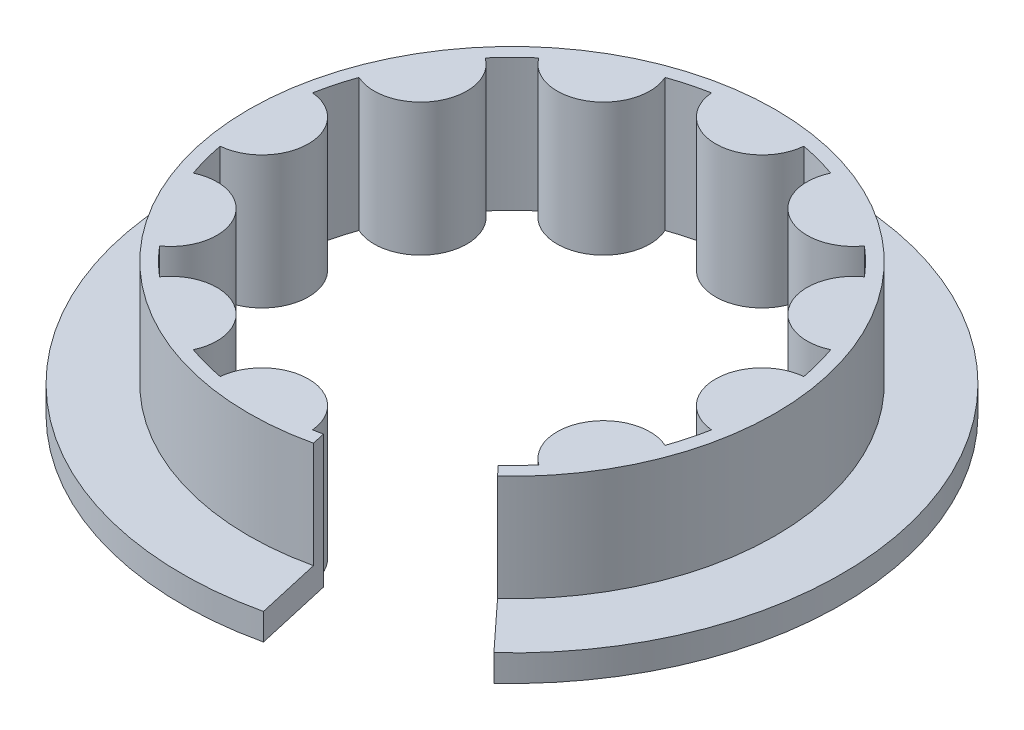
ISO-10303-21;
HEADER;
FILE_DESCRIPTION(('STEP AP214'),'2;1');
FILE_NAME('part.step','',(''),(''),'','','');
FILE_SCHEMA(('AUTOMOTIVE_DESIGN { 1 0 10303 214 1 1 1 1 }'));
ENDSEC;
DATA;
#1=APPLICATION_CONTEXT('core data for automotive mechanical design processes');
#2=APPLICATION_PROTOCOL_DEFINITION('international standard','automotive_design',2000,#1);
#3=PRODUCT_CONTEXT('',#1,'mechanical');
#4=PRODUCT('Part','Part','',(#3));
#5=PRODUCT_RELATED_PRODUCT_CATEGORY('part','',(#4));
#6=PRODUCT_DEFINITION_FORMATION('','',#4);
#7=PRODUCT_DEFINITION_CONTEXT('part definition',#1,'design');
#8=PRODUCT_DEFINITION('design','',#6,#7);
#9=PRODUCT_DEFINITION_SHAPE('','',#8);
#10=(LENGTH_UNIT() NAMED_UNIT(*) SI_UNIT(.MILLI.,.METRE.));
#11=(NAMED_UNIT(*) PLANE_ANGLE_UNIT() SI_UNIT($,.RADIAN.));
#12=(NAMED_UNIT(*) SI_UNIT($,.STERADIAN.) SOLID_ANGLE_UNIT());
#13=UNCERTAINTY_MEASURE_WITH_UNIT(LENGTH_MEASURE(1.E-05),#10,'distance_accuracy_value','');
#14=(GEOMETRIC_REPRESENTATION_CONTEXT(3) GLOBAL_UNCERTAINTY_ASSIGNED_CONTEXT((#13)) GLOBAL_UNIT_ASSIGNED_CONTEXT((#10,
#11,#12)) REPRESENTATION_CONTEXT('',''));
#15=CARTESIAN_POINT('',(0.,0.,0.));
#16=DIRECTION('',(0.,0.,1.));
#17=DIRECTION('',(1.,0.,0.));
#18=AXIS2_PLACEMENT_3D('',#15,#16,#17);
#19=CARTESIAN_POINT('',(-0.572563935418701,5.,1.24466409401336E-13));
#20=DIRECTION('',(0.,-1.,0.));
#21=DIRECTION('',(0.,0.,-1.));
#22=AXIS2_PLACEMENT_3D('',#19,#20,#21);
#23=CYLINDRICAL_SURFACE('',#22,12.4274360645813);
#24=DIRECTION('',(0.,1.,0.));
#25=VECTOR('',#24,1.);
#26=CARTESIAN_POINT('',(7.86676479083981,0.,9.12243924558592));
#27=LINE('',#26,#25);
#28=CARTESIAN_POINT('',(7.86676479083981,0.,9.12243924558592));
#29=VERTEX_POINT('',#28);
#30=CARTESIAN_POINT('',(7.86676479083981,1.,9.12243924558592));
#31=VERTEX_POINT('',#30);
#32=EDGE_CURVE('E67',#29,#31,#27,.T.);
#33=ORIENTED_EDGE('',*,*,#32,.F.);
#34=CARTESIAN_POINT('',(-0.572563935418701,0.,1.24466409401336E-13));
#35=DIRECTION('',(0.,1.,0.));
#36=DIRECTION('',(0.,0.,1.));
#37=AXIS2_PLACEMENT_3D('',#34,#35,#36);
#38=CIRCLE('',#37,12.4274360645813);
#39=CARTESIAN_POINT('',(2.17488950961602,0.,12.1199284942868));
#40=VERTEX_POINT('',#39);
#41=EDGE_CURVE('E247',#29,#40,#38,.T.);
#42=ORIENTED_EDGE('',*,*,#41,.T.);
#43=DIRECTION('',(0.,1.,0.));
#44=VECTOR('',#43,1.);
#45=CARTESIAN_POINT('',(2.17488950961602,0.,12.1199284942868));
#46=LINE('',#45,#44);
#47=CARTESIAN_POINT('',(2.17488950961602,1.,12.1199284942868));
#48=VERTEX_POINT('',#47);
#49=EDGE_CURVE('E433',#40,#48,#46,.T.);
#50=ORIENTED_EDGE('',*,*,#49,.T.);
#51=CARTESIAN_POINT('',(-0.572563935418701,1.,1.24466409401336E-13));
#52=DIRECTION('',(0.,1.,0.));
#53=DIRECTION('',(0.,0.,1.));
#54=AXIS2_PLACEMENT_3D('',#51,#52,#53);
#55=CIRCLE('',#54,12.4274360645813);
#56=EDGE_CURVE('E282',#48,#31,#55,.F.);
#57=ORIENTED_EDGE('',*,*,#56,.T.);
#58=EDGE_LOOP('',(#33,#42,#50,#57));
#59=FACE_BOUND('',#58,.T.);
#60=ADVANCED_FACE('F43',(#59),#23,.T.);
#61=CARTESIAN_POINT('',(-0.572563935418701,5.,1.24466409401336E-13));
#62=DIRECTION('',(0.,-1.,0.));
#63=DIRECTION('',(0.,0.,-1.));
#64=AXIS2_PLACEMENT_3D('',#61,#62,#63);
#65=CYLINDRICAL_SURFACE('',#64,9.4274360645813);
#66=CARTESIAN_POINT('',(-0.572563935418701,0.,1.24466409401336E-13));
#67=DIRECTION('',(0.,1.,0.));
#68=DIRECTION('',(0.,0.,1.));
#69=AXIS2_PLACEMENT_3D('',#66,#67,#68);
#70=CIRCLE('',#69,9.4274360645813);
#71=CARTESIAN_POINT('',(5.82949933662976,0.,6.92026998118267));
#72=VERTEX_POINT('',#71);
#73=CARTESIAN_POINT('',(6.5799481179883,0.,6.14150812729554));
#74=VERTEX_POINT('',#73);
#75=EDGE_CURVE('E243',#72,#74,#70,.T.);
#76=ORIENTED_EDGE('',*,*,#75,.F.);
#77=DIRECTION('',(0.,1.,0.));
#78=VECTOR('',#77,1.);
#79=CARTESIAN_POINT('',(5.82949933662976,0.,6.92026998118267));
#80=LINE('',#79,#78);
#81=CARTESIAN_POINT('',(5.82949933662976,5.,6.92026998118267));
#82=VERTEX_POINT('',#81);
#83=EDGE_CURVE('E226',#72,#82,#80,.T.);
#84=ORIENTED_EDGE('',*,*,#83,.T.);
#85=CARTESIAN_POINT('',(-0.572563935418701,5.,1.24466409401336E-13));
#86=DIRECTION('',(0.,1.,0.));
#87=DIRECTION('',(0.,0.,1.));
#88=AXIS2_PLACEMENT_3D('',#85,#86,#87);
#89=CIRCLE('',#88,9.4274360645813);
#90=CARTESIAN_POINT('',(6.5799481179883,5.,6.14150812729554));
#91=VERTEX_POINT('',#90);
#92=EDGE_CURVE('E368',#82,#91,#89,.T.);
#93=ORIENTED_EDGE('',*,*,#92,.T.);
#94=DIRECTION('',(0.,-1.,0.));
#95=VECTOR('',#94,1.);
#96=CARTESIAN_POINT('',(6.5799481179883,5.,6.14150812729554));
#97=LINE('',#96,#95);
#98=EDGE_CURVE('E253',#91,#74,#97,.T.);
#99=ORIENTED_EDGE('',*,*,#98,.T.);
#100=EDGE_LOOP('',(#76,#84,#93,#99));
#101=FACE_BOUND('',#100,.T.);
#102=ADVANCED_FACE('F251',(#101),#65,.F.);
#103=CARTESIAN_POINT('',(-0.572563935418701,-35.1500972561108,1.24466409401336E-13));
#104=DIRECTION('',(0.,1.,0.));
#105=DIRECTION('',(0.,0.,1.));
#106=AXIS2_PLACEMENT_3D('',#103,#104,#105);
#107=CYLINDRICAL_SURFACE('',#106,9.9274360645813);
#108=CARTESIAN_POINT('',(-0.572563935418701,5.,1.24466409401336E-13));
#109=DIRECTION('',(0.,1.,0.));
#110=DIRECTION('',(0.,0.,1.));
#111=AXIS2_PLACEMENT_3D('',#108,#109,#110);
#112=CIRCLE('',#111,9.9274360645813);
#113=CARTESIAN_POINT('',(6.1690435789981,5.,7.28729819191654));
#114=VERTEX_POINT('',#113);
#115=CARTESIAN_POINT('',(1.62219033845209,5.,9.68178911636056));
#116=VERTEX_POINT('',#115);
#117=EDGE_CURVE('E443',#114,#116,#112,.T.);
#118=ORIENTED_EDGE('',*,*,#117,.F.);
#119=DIRECTION('',(0.,1.,0.));
#120=VECTOR('',#119,1.);
#121=CARTESIAN_POINT('',(6.1690435789981,-35.1500972561108,7.28729819191654));
#122=LINE('',#121,#120);
#123=CARTESIAN_POINT('',(6.1690435789981,1.,7.28729819191654));
#124=VERTEX_POINT('',#123);
#125=EDGE_CURVE('E447',#114,#124,#122,.F.);
#126=ORIENTED_EDGE('',*,*,#125,.T.);
#127=CARTESIAN_POINT('',(-0.572563935418701,1.,1.24466409401336E-13));
#128=DIRECTION('',(0.,1.,0.));
#129=DIRECTION('',(0.,0.,1.));
#130=AXIS2_PLACEMENT_3D('',#127,#128,#129);
#131=CIRCLE('',#130,9.9274360645813);
#132=CARTESIAN_POINT('',(1.62219033845209,1.,9.68178911636056));
#133=VERTEX_POINT('',#132);
#134=EDGE_CURVE('E274',#133,#124,#131,.F.);
#135=ORIENTED_EDGE('',*,*,#134,.F.);
#136=DIRECTION('',(0.,1.,0.));
#137=VECTOR('',#136,1.);
#138=CARTESIAN_POINT('',(1.62219033845209,-35.1500972561108,9.68178911636056));
#139=LINE('',#138,#137);
#140=EDGE_CURVE('E59',#116,#133,#139,.F.);
#141=ORIENTED_EDGE('',*,*,#140,.F.);
#142=EDGE_LOOP('',(#118,#126,#135,#141));
#143=FACE_BOUND('',#142,.T.);
#144=ADVANCED_FACE('F567',(#143),#107,.T.);
#145=CARTESIAN_POINT('',(0.,1.,0.));
#146=DIRECTION('',(0.,1.,0.));
#147=DIRECTION('',(0.,0.,1.));
#148=AXIS2_PLACEMENT_3D('',#145,#146,#147);
#149=PLANE('',#148);
#150=ORIENTED_EDGE('',*,*,#134,.T.);
#151=DIRECTION('',(0.679088484736682,0.,0.734056421467749));
#152=VECTOR('',#151,1.);
#153=CARTESIAN_POINT('',(-0.30851968100289,1.,0.285416974167703));
#154=LINE('',#153,#152);
#155=EDGE_CURVE('E12',#124,#31,#154,.T.);
#156=ORIENTED_EDGE('',*,*,#155,.T.);
#157=ORIENTED_EDGE('',*,*,#56,.F.);
#158=DIRECTION('',(0.221079668465572,0.,0.975255751170509));
#159=VECTOR('',#158,1.);
#160=CARTESIAN_POINT('',(-0.544579174656585,1.,0.123450062449602));
#161=LINE('',#160,#159);
#162=EDGE_CURVE('E52',#133,#48,#161,.T.);
#163=ORIENTED_EDGE('',*,*,#162,.F.);
#164=EDGE_LOOP('',(#150,#156,#157,#163));
#165=FACE_BOUND('',#164,.T.);
#166=ADVANCED_FACE('F441',(#165),#149,.T.);
#167=CARTESIAN_POINT('',(0.,5.,0.));
#168=DIRECTION('',(0.,1.,0.));
#169=DIRECTION('',(0.,0.,1.));
#170=AXIS2_PLACEMENT_3D('',#167,#168,#169);
#171=PLANE('',#170);
#172=ORIENTED_EDGE('',*,*,#92,.F.);
#173=DIRECTION('',(0.679088484736682,0.,0.734056421467749));
#174=VECTOR('',#173,1.);
#175=CARTESIAN_POINT('',(-0.30851968100289,5.,0.285416974167703));
#176=LINE('',#175,#174);
#177=EDGE_CURVE('E231',#82,#114,#176,.T.);
#178=ORIENTED_EDGE('',*,*,#177,.T.);
#179=ORIENTED_EDGE('',*,*,#117,.T.);
#180=DIRECTION('',(0.221079668465572,0.,0.975255751170509));
#181=VECTOR('',#180,1.);
#182=CARTESIAN_POINT('',(-0.544579174656585,5.,0.123450062449602));
#183=LINE('',#182,#181);
#184=CARTESIAN_POINT('',(1.51165050421931,5.,9.1941612407753));
#185=VERTEX_POINT('',#184);
#186=EDGE_CURVE('E249',#185,#116,#183,.T.);
#187=ORIENTED_EDGE('',*,*,#186,.F.);
#188=CARTESIAN_POINT('',(1.16988209366398,5.,9.26501120277275));
#189=VERTEX_POINT('',#188);
#190=EDGE_CURVE('E262',#189,#185,#89,.T.);
#191=ORIENTED_EDGE('',*,*,#190,.F.);
#192=CARTESIAN_POINT('',(-0.572563935418825,5.,9.42743606458142));
#193=DIRECTION('',(0.,1.,0.));
#194=DIRECTION('',(0.,0.,1.));
#195=AXIS2_PLACEMENT_3D('',#192,#193,#194);
#196=CIRCLE('',#195,1.75);
#197=CARTESIAN_POINT('',(-2.31500996450162,5.,9.2650112027727));
#198=VERTEX_POINT('',#197);
#199=EDGE_CURVE('E455',#189,#198,#196,.T.);
#200=ORIENTED_EDGE('',*,*,#199,.T.);
#201=CARTESIAN_POINT('',(-3.69606701089609,5.,8.89495808248997));
#202=VERTEX_POINT('',#201);
#203=EDGE_CURVE('E456',#202,#198,#89,.T.);
#204=ORIENTED_EDGE('',*,*,#203,.F.);
#205=CARTESIAN_POINT('',(-5.28628196770945,5.,8.16439912448106));
#206=DIRECTION('',(0.,1.,0.));
#207=DIRECTION('',(0.,0.,1.));
#208=AXIS2_PLACEMENT_3D('',#205,#206,#207);
#209=CIRCLE('',#208,1.75);
#210=CARTESIAN_POINT('',(-6.71407206271411,5.,7.15251205340713));
#211=VERTEX_POINT('',#210);
#212=EDGE_CURVE('E459',#202,#211,#209,.T.);
#213=ORIENTED_EDGE('',*,*,#212,.T.);
#214=CARTESIAN_POINT('',(-7.72507598882586,5.,6.14150812729536));
#215=VERTEX_POINT('',#214);
#216=EDGE_CURVE('E462',#215,#211,#89,.T.);
#217=ORIENTED_EDGE('',*,*,#216,.F.);
#218=CARTESIAN_POINT('',(-8.73696305989976,5.,4.71371803229067));
#219=DIRECTION('',(0.,1.,0.));
#220=DIRECTION('',(0.,0.,1.));
#221=AXIS2_PLACEMENT_3D('',#218,#219,#220);
#222=CIRCLE('',#221,1.75);
#223=CARTESIAN_POINT('',(-9.46752201790862,5.,3.12350307547728));
#224=VERTEX_POINT('',#223);
#225=EDGE_CURVE('E463',#215,#224,#222,.T.);
#226=ORIENTED_EDGE('',*,*,#225,.T.);
#227=CARTESIAN_POINT('',(-9.83757513819132,5.,1.7424460290828));
#228=VERTEX_POINT('',#227);
#229=EDGE_CURVE('E466',#228,#224,#89,.T.);
#230=ORIENTED_EDGE('',*,*,#229,.F.);
#231=CARTESIAN_POINT('',(-10.,5.,0.));
#232=DIRECTION('',(0.,1.,0.));
#233=DIRECTION('',(0.,0.,1.));
#234=AXIS2_PLACEMENT_3D('',#231,#232,#233);
#235=CIRCLE('',#234,1.75);
#236=CARTESIAN_POINT('',(-9.83757513819127,5.,-1.7424460290828));
#237=VERTEX_POINT('',#236);
#238=EDGE_CURVE('E467',#228,#237,#235,.T.);
#239=ORIENTED_EDGE('',*,*,#238,.T.);
#240=CARTESIAN_POINT('',(-9.46752201790854,5.,-3.12350307547727));
#241=VERTEX_POINT('',#240);
#242=EDGE_CURVE('E470',#241,#237,#89,.T.);
#243=ORIENTED_EDGE('',*,*,#242,.F.);
#244=CARTESIAN_POINT('',(-8.73696305989963,5.,-4.71371803229064));
#245=DIRECTION('',(0.,1.,0.));
#246=DIRECTION('',(0.,0.,1.));
#247=AXIS2_PLACEMENT_3D('',#244,#245,#246);
#248=CIRCLE('',#247,1.75);
#249=CARTESIAN_POINT('',(-7.7250759888257,5.,-6.1415081272953));
#250=VERTEX_POINT('',#249);
#251=EDGE_CURVE('E471',#241,#250,#248,.T.);
#252=ORIENTED_EDGE('',*,*,#251,.T.);
#253=CARTESIAN_POINT('',(-6.71407206271393,5.,-7.15251205340704));
#254=VERTEX_POINT('',#253);
#255=EDGE_CURVE('E474',#254,#250,#89,.T.);
#256=ORIENTED_EDGE('',*,*,#255,.F.);
#257=CARTESIAN_POINT('',(-5.28628196770924,5.,-8.16439912448094));
#258=DIRECTION('',(0.,1.,0.));
#259=DIRECTION('',(0.,0.,1.));
#260=AXIS2_PLACEMENT_3D('',#257,#258,#259);
#261=CIRCLE('',#260,1.75);
#262=CARTESIAN_POINT('',(-3.69606701089586,5.,-8.8949580824898));
#263=VERTEX_POINT('',#262);
#264=EDGE_CURVE('E475',#254,#263,#261,.T.);
#265=ORIENTED_EDGE('',*,*,#264,.T.);
#266=CARTESIAN_POINT('',(-2.31500996450138,5.,-9.2650112027725));
#267=VERTEX_POINT('',#266);
#268=EDGE_CURVE('E478',#267,#263,#89,.T.);
#269=ORIENTED_EDGE('',*,*,#268,.F.);
#270=CARTESIAN_POINT('',(-0.572563935418576,5.,-9.42743606458117));
#271=DIRECTION('',(0.,1.,0.));
#272=DIRECTION('',(0.,0.,1.));
#273=AXIS2_PLACEMENT_3D('',#270,#271,#272);
#274=CIRCLE('',#273,1.75);
#275=CARTESIAN_POINT('',(1.16988209366422,5.,-9.26501120277245));
#276=VERTEX_POINT('',#275);
#277=EDGE_CURVE('E479',#267,#276,#274,.T.);
#278=ORIENTED_EDGE('',*,*,#277,.T.);
#279=CARTESIAN_POINT('',(2.55093914005869,5.,-8.89495808248972));
#280=VERTEX_POINT('',#279);
#281=EDGE_CURVE('E482',#280,#276,#89,.T.);
#282=ORIENTED_EDGE('',*,*,#281,.F.);
#283=CARTESIAN_POINT('',(4.14115409687206,5.,-8.16439912448081));
#284=DIRECTION('',(0.,1.,0.));
#285=DIRECTION('',(0.,0.,1.));
#286=AXIS2_PLACEMENT_3D('',#283,#284,#285);
#287=CIRCLE('',#286,1.75);
#288=CARTESIAN_POINT('',(5.56894419187672,5.,-7.15251205340688));
#289=VERTEX_POINT('',#288);
#290=EDGE_CURVE('E483',#280,#289,#287,.T.);
#291=ORIENTED_EDGE('',*,*,#290,.T.);
#292=CARTESIAN_POINT('',(6.57994811798847,5.,-6.14150812729511));
#293=VERTEX_POINT('',#292);
#294=EDGE_CURVE('E486',#293,#289,#89,.T.);
#295=ORIENTED_EDGE('',*,*,#294,.F.);
#296=CARTESIAN_POINT('',(7.59183518906236,5.,-4.71371803229042));
#297=DIRECTION('',(0.,1.,0.));
#298=DIRECTION('',(0.,0.,1.));
#299=AXIS2_PLACEMENT_3D('',#296,#297,#298);
#300=CIRCLE('',#299,1.75);
#301=CARTESIAN_POINT('',(8.32239414707123,5.,-3.12350307547703));
#302=VERTEX_POINT('',#301);
#303=EDGE_CURVE('E487',#293,#302,#300,.T.);
#304=ORIENTED_EDGE('',*,*,#303,.T.);
#305=CARTESIAN_POINT('',(8.69244726735392,5.,-1.74244602908255));
#306=VERTEX_POINT('',#305);
#307=EDGE_CURVE('E490',#306,#302,#89,.T.);
#308=ORIENTED_EDGE('',*,*,#307,.F.);
#309=CARTESIAN_POINT('',(8.8548721291626,5.,2.50380376076571E-13));
#310=DIRECTION('',(0.,1.,0.));
#311=DIRECTION('',(0.,0.,1.));
#312=AXIS2_PLACEMENT_3D('',#309,#310,#311);
#313=CIRCLE('',#312,1.75);
#314=CARTESIAN_POINT('',(8.69244726735387,5.,1.74244602908305));
#315=VERTEX_POINT('',#314);
#316=EDGE_CURVE('E491',#306,#315,#313,.T.);
#317=ORIENTED_EDGE('',*,*,#316,.T.);
#318=CARTESIAN_POINT('',(8.32239414707114,5.,3.12350307547751));
#319=VERTEX_POINT('',#318);
#320=EDGE_CURVE('E493',#319,#315,#89,.T.);
#321=ORIENTED_EDGE('',*,*,#320,.F.);
#322=CARTESIAN_POINT('',(7.59183518906224,5.,4.71371803229088));
#323=DIRECTION('',(0.,1.,0.));
#324=DIRECTION('',(0.,0.,1.));
#325=AXIS2_PLACEMENT_3D('',#322,#323,#324);
#326=CIRCLE('',#325,1.75);
#327=EDGE_CURVE('E494',#319,#91,#326,.T.);
#328=ORIENTED_EDGE('',*,*,#327,.T.);
#329=EDGE_LOOP('',(#172,#178,#179,#187,#191,#200,#204,#213,#217,#226,#230,#239,#243,#252,#256,
#265,#269,#278,#282,#291,#295,#304,#308,#317,#321,#328));
#330=FACE_BOUND('',#329,.T.);
#331=ADVANCED_FACE('F543',(#330),#171,.T.);
#332=DIRECTION('',(0.,1.,0.));
#333=VECTOR('',#332,1.);
#334=CARTESIAN_POINT('',(1.51165050421931,0.,9.1941612407753));
#335=LINE('',#334,#333);
#336=CARTESIAN_POINT('',(1.51165050421931,0.,9.1941612407753));
#337=VERTEX_POINT('',#336);
#338=EDGE_CURVE('E236',#337,#185,#335,.T.);
#339=ORIENTED_EDGE('',*,*,#338,.F.);
#340=CARTESIAN_POINT('',(1.16988209366398,0.,9.26501120277275));
#341=VERTEX_POINT('',#340);
#342=EDGE_CURVE('E259',#341,#337,#70,.T.);
#343=ORIENTED_EDGE('',*,*,#342,.F.);
#344=DIRECTION('',(0.,-1.,0.));
#345=VECTOR('',#344,1.);
#346=CARTESIAN_POINT('',(1.16988209366398,5.,9.26501120277275));
#347=LINE('',#346,#345);
#348=EDGE_CURVE('E428',#189,#341,#347,.T.);
#349=ORIENTED_EDGE('',*,*,#348,.F.);
#350=ORIENTED_EDGE('',*,*,#190,.T.);
#351=EDGE_LOOP('',(#339,#343,#349,#350));
#352=FACE_BOUND('',#351,.T.);
#353=ADVANCED_FACE('F551',(#352),#65,.F.);
#354=CARTESIAN_POINT('',(-0.572563935418825,5.,9.42743606458142));
#355=DIRECTION('',(0.,-1.,0.));
#356=DIRECTION('',(0.,0.,-1.));
#357=AXIS2_PLACEMENT_3D('',#354,#355,#356);
#358=CYLINDRICAL_SURFACE('',#357,1.75);
#359=CARTESIAN_POINT('',(-0.572563935418825,0.,9.42743606458142));
#360=DIRECTION('',(0.,1.,0.));
#361=DIRECTION('',(0.,0.,1.));
#362=AXIS2_PLACEMENT_3D('',#359,#360,#361);
#363=CIRCLE('',#362,1.75);
#364=CARTESIAN_POINT('',(-2.31500996450162,0.,9.2650112027727));
#365=VERTEX_POINT('',#364);
#366=EDGE_CURVE('E273',#341,#365,#363,.T.);
#367=ORIENTED_EDGE('',*,*,#366,.T.);
#368=DIRECTION('',(0.,-1.,0.));
#369=VECTOR('',#368,1.);
#370=CARTESIAN_POINT('',(-2.31500996450162,5.,9.2650112027727));
#371=LINE('',#370,#369);
#372=EDGE_CURVE('E425',#198,#365,#371,.T.);
#373=ORIENTED_EDGE('',*,*,#372,.F.);
#374=ORIENTED_EDGE('',*,*,#199,.F.);
#375=ORIENTED_EDGE('',*,*,#348,.T.);
#376=EDGE_LOOP('',(#367,#373,#374,#375));
#377=FACE_BOUND('',#376,.T.);
#378=ADVANCED_FACE('F45',(#377),#358,.T.);
#379=CARTESIAN_POINT('',(-3.69606701089609,0.,8.89495808248997));
#380=VERTEX_POINT('',#379);
#381=EDGE_CURVE('E275',#380,#365,#70,.T.);
#382=ORIENTED_EDGE('',*,*,#381,.F.);
#383=DIRECTION('',(0.,-1.,0.));
#384=VECTOR('',#383,1.);
#385=CARTESIAN_POINT('',(-3.69606701089609,5.,8.89495808248997));
#386=LINE('',#385,#384);
#387=EDGE_CURVE('E422',#202,#380,#386,.T.);
#388=ORIENTED_EDGE('',*,*,#387,.F.);
#389=ORIENTED_EDGE('',*,*,#203,.T.);
#390=ORIENTED_EDGE('',*,*,#372,.T.);
#391=EDGE_LOOP('',(#382,#388,#389,#390));
#392=FACE_BOUND('',#391,.T.);
#393=ADVANCED_FACE('F540',(#392),#65,.F.);
#394=CARTESIAN_POINT('',(-5.28628196770945,5.,8.16439912448106));
#395=DIRECTION('',(0.,-1.,0.));
#396=DIRECTION('',(0.,0.,-1.));
#397=AXIS2_PLACEMENT_3D('',#394,#395,#396);
#398=CYLINDRICAL_SURFACE('',#397,1.75);
#399=CARTESIAN_POINT('',(-5.28628196770945,0.,8.16439912448106));
#400=DIRECTION('',(0.,1.,0.));
#401=DIRECTION('',(0.,0.,1.));
#402=AXIS2_PLACEMENT_3D('',#399,#400,#401);
#403=CIRCLE('',#402,1.75);
#404=CARTESIAN_POINT('',(-6.71407206271411,0.,7.15251205340713));
#405=VERTEX_POINT('',#404);
#406=EDGE_CURVE('E286',#380,#405,#403,.T.);
#407=ORIENTED_EDGE('',*,*,#406,.T.);
#408=DIRECTION('',(0.,-1.,0.));
#409=VECTOR('',#408,1.);
#410=CARTESIAN_POINT('',(-6.71407206271411,5.,7.15251205340713));
#411=LINE('',#410,#409);
#412=EDGE_CURVE('E419',#211,#405,#411,.T.);
#413=ORIENTED_EDGE('',*,*,#412,.F.);
#414=ORIENTED_EDGE('',*,*,#212,.F.);
#415=ORIENTED_EDGE('',*,*,#387,.T.);
#416=EDGE_LOOP('',(#407,#413,#414,#415));
#417=FACE_BOUND('',#416,.T.);
#418=ADVANCED_FACE('F626',(#417),#398,.T.);
#419=CARTESIAN_POINT('',(-7.72507598882586,0.,6.14150812729536));
#420=VERTEX_POINT('',#419);
#421=EDGE_CURVE('E287',#420,#405,#70,.T.);
#422=ORIENTED_EDGE('',*,*,#421,.F.);
#423=DIRECTION('',(0.,-1.,0.));
#424=VECTOR('',#423,1.);
#425=CARTESIAN_POINT('',(-7.72507598882586,5.,6.14150812729536));
#426=LINE('',#425,#424);
#427=EDGE_CURVE('E416',#215,#420,#426,.T.);
#428=ORIENTED_EDGE('',*,*,#427,.F.);
#429=ORIENTED_EDGE('',*,*,#216,.T.);
#430=ORIENTED_EDGE('',*,*,#412,.T.);
#431=EDGE_LOOP('',(#422,#428,#429,#430));
#432=FACE_BOUND('',#431,.T.);
#433=ADVANCED_FACE('F624',(#432),#65,.F.);
#434=CARTESIAN_POINT('',(-8.73696305989976,5.,4.71371803229067));
#435=DIRECTION('',(0.,-1.,0.));
#436=DIRECTION('',(0.,0.,-1.));
#437=AXIS2_PLACEMENT_3D('',#434,#435,#436);
#438=CYLINDRICAL_SURFACE('',#437,1.75);
#439=CARTESIAN_POINT('',(-8.73696305989976,0.,4.71371803229067));
#440=DIRECTION('',(0.,1.,0.));
#441=DIRECTION('',(0.,0.,1.));
#442=AXIS2_PLACEMENT_3D('',#439,#440,#441);
#443=CIRCLE('',#442,1.75);
#444=CARTESIAN_POINT('',(-9.46752201790862,0.,3.12350307547728));
#445=VERTEX_POINT('',#444);
#446=EDGE_CURVE('E295',#420,#445,#443,.T.);
#447=ORIENTED_EDGE('',*,*,#446,.T.);
#448=DIRECTION('',(0.,-1.,0.));
#449=VECTOR('',#448,1.);
#450=CARTESIAN_POINT('',(-9.46752201790862,5.,3.12350307547728));
#451=LINE('',#450,#449);
#452=EDGE_CURVE('E413',#224,#445,#451,.T.);
#453=ORIENTED_EDGE('',*,*,#452,.F.);
#454=ORIENTED_EDGE('',*,*,#225,.F.);
#455=ORIENTED_EDGE('',*,*,#427,.T.);
#456=EDGE_LOOP('',(#447,#453,#454,#455));
#457=FACE_BOUND('',#456,.T.);
#458=ADVANCED_FACE('F622',(#457),#438,.T.);
#459=CARTESIAN_POINT('',(-9.83757513819132,0.,1.7424460290828));
#460=VERTEX_POINT('',#459);
#461=EDGE_CURVE('E296',#460,#445,#70,.T.);
#462=ORIENTED_EDGE('',*,*,#461,.F.);
#463=DIRECTION('',(0.,-1.,0.));
#464=VECTOR('',#463,1.);
#465=CARTESIAN_POINT('',(-9.83757513819132,5.,1.7424460290828));
#466=LINE('',#465,#464);
#467=EDGE_CURVE('E410',#228,#460,#466,.T.);
#468=ORIENTED_EDGE('',*,*,#467,.F.);
#469=ORIENTED_EDGE('',*,*,#229,.T.);
#470=ORIENTED_EDGE('',*,*,#452,.T.);
#471=EDGE_LOOP('',(#462,#468,#469,#470));
#472=FACE_BOUND('',#471,.T.);
#473=ADVANCED_FACE('F620',(#472),#65,.F.);
#474=CARTESIAN_POINT('',(-10.,5.,0.));
#475=DIRECTION('',(0.,-1.,0.));
#476=DIRECTION('',(0.,0.,-1.));
#477=AXIS2_PLACEMENT_3D('',#474,#475,#476);
#478=CYLINDRICAL_SURFACE('',#477,1.75);
#479=CARTESIAN_POINT('',(-10.,0.,0.));
#480=DIRECTION('',(0.,1.,0.));
#481=DIRECTION('',(0.,0.,1.));
#482=AXIS2_PLACEMENT_3D('',#479,#480,#481);
#483=CIRCLE('',#482,1.75);
#484=CARTESIAN_POINT('',(-9.83757513819127,0.,-1.7424460290828));
#485=VERTEX_POINT('',#484);
#486=EDGE_CURVE('E304',#460,#485,#483,.T.);
#487=ORIENTED_EDGE('',*,*,#486,.T.);
#488=DIRECTION('',(0.,-1.,0.));
#489=VECTOR('',#488,1.);
#490=CARTESIAN_POINT('',(-9.83757513819127,5.,-1.7424460290828));
#491=LINE('',#490,#489);
#492=EDGE_CURVE('E407',#237,#485,#491,.T.);
#493=ORIENTED_EDGE('',*,*,#492,.F.);
#494=ORIENTED_EDGE('',*,*,#238,.F.);
#495=ORIENTED_EDGE('',*,*,#467,.T.);
#496=EDGE_LOOP('',(#487,#493,#494,#495));
#497=FACE_BOUND('',#496,.T.);
#498=ADVANCED_FACE('F617',(#497),#478,.T.);
#499=CARTESIAN_POINT('',(-9.46752201790854,0.,-3.12350307547727));
#500=VERTEX_POINT('',#499);
#501=EDGE_CURVE('E305',#500,#485,#70,.T.);
#502=ORIENTED_EDGE('',*,*,#501,.F.);
#503=DIRECTION('',(0.,-1.,0.));
#504=VECTOR('',#503,1.);
#505=CARTESIAN_POINT('',(-9.46752201790854,5.,-3.12350307547727));
#506=LINE('',#505,#504);
#507=EDGE_CURVE('E404',#241,#500,#506,.T.);
#508=ORIENTED_EDGE('',*,*,#507,.F.);
#509=ORIENTED_EDGE('',*,*,#242,.T.);
#510=ORIENTED_EDGE('',*,*,#492,.T.);
#511=EDGE_LOOP('',(#502,#508,#509,#510));
#512=FACE_BOUND('',#511,.T.);
#513=ADVANCED_FACE('F615',(#512),#65,.F.);
#514=CARTESIAN_POINT('',(-8.73696305989963,5.,-4.71371803229064));
#515=DIRECTION('',(0.,-1.,0.));
#516=DIRECTION('',(0.,0.,-1.));
#517=AXIS2_PLACEMENT_3D('',#514,#515,#516);
#518=CYLINDRICAL_SURFACE('',#517,1.75);
#519=CARTESIAN_POINT('',(-8.73696305989963,0.,-4.71371803229064));
#520=DIRECTION('',(0.,1.,0.));
#521=DIRECTION('',(0.,0.,1.));
#522=AXIS2_PLACEMENT_3D('',#519,#520,#521);
#523=CIRCLE('',#522,1.75);
#524=CARTESIAN_POINT('',(-7.7250759888257,0.,-6.1415081272953));
#525=VERTEX_POINT('',#524);
#526=EDGE_CURVE('E313',#500,#525,#523,.T.);
#527=ORIENTED_EDGE('',*,*,#526,.T.);
#528=DIRECTION('',(0.,-1.,0.));
#529=VECTOR('',#528,1.);
#530=CARTESIAN_POINT('',(-7.7250759888257,5.,-6.1415081272953));
#531=LINE('',#530,#529);
#532=EDGE_CURVE('E401',#250,#525,#531,.T.);
#533=ORIENTED_EDGE('',*,*,#532,.F.);
#534=ORIENTED_EDGE('',*,*,#251,.F.);
#535=ORIENTED_EDGE('',*,*,#507,.T.);
#536=EDGE_LOOP('',(#527,#533,#534,#535));
#537=FACE_BOUND('',#536,.T.);
#538=ADVANCED_FACE('F612',(#537),#518,.T.);
#539=CARTESIAN_POINT('',(-6.71407206271393,0.,-7.15251205340704));
#540=VERTEX_POINT('',#539);
#541=EDGE_CURVE('E314',#540,#525,#70,.T.);
#542=ORIENTED_EDGE('',*,*,#541,.F.);
#543=DIRECTION('',(0.,-1.,0.));
#544=VECTOR('',#543,1.);
#545=CARTESIAN_POINT('',(-6.71407206271393,5.,-7.15251205340704));
#546=LINE('',#545,#544);
#547=EDGE_CURVE('E398',#254,#540,#546,.T.);
#548=ORIENTED_EDGE('',*,*,#547,.F.);
#549=ORIENTED_EDGE('',*,*,#255,.T.);
#550=ORIENTED_EDGE('',*,*,#532,.T.);
#551=EDGE_LOOP('',(#542,#548,#549,#550));
#552=FACE_BOUND('',#551,.T.);
#553=ADVANCED_FACE('F610',(#552),#65,.F.);
#554=CARTESIAN_POINT('',(-5.28628196770924,5.,-8.16439912448094));
#555=DIRECTION('',(0.,-1.,0.));
#556=DIRECTION('',(0.,0.,-1.));
#557=AXIS2_PLACEMENT_3D('',#554,#555,#556);
#558=CYLINDRICAL_SURFACE('',#557,1.75);
#559=CARTESIAN_POINT('',(-5.28628196770924,0.,-8.16439912448094));
#560=DIRECTION('',(0.,1.,0.));
#561=DIRECTION('',(0.,0.,1.));
#562=AXIS2_PLACEMENT_3D('',#559,#560,#561);
#563=CIRCLE('',#562,1.75);
#564=CARTESIAN_POINT('',(-3.69606701089586,0.,-8.8949580824898));
#565=VERTEX_POINT('',#564);
#566=EDGE_CURVE('E322',#540,#565,#563,.T.);
#567=ORIENTED_EDGE('',*,*,#566,.T.);
#568=DIRECTION('',(0.,-1.,0.));
#569=VECTOR('',#568,1.);
#570=CARTESIAN_POINT('',(-3.69606701089586,5.,-8.8949580824898));
#571=LINE('',#570,#569);
#572=EDGE_CURVE('E395',#263,#565,#571,.T.);
#573=ORIENTED_EDGE('',*,*,#572,.F.);
#574=ORIENTED_EDGE('',*,*,#264,.F.);
#575=ORIENTED_EDGE('',*,*,#547,.T.);
#576=EDGE_LOOP('',(#567,#573,#574,#575));
#577=FACE_BOUND('',#576,.T.);
#578=ADVANCED_FACE('F607',(#577),#558,.T.);
#579=CARTESIAN_POINT('',(-2.31500996450138,0.,-9.2650112027725));
#580=VERTEX_POINT('',#579);
#581=EDGE_CURVE('E323',#580,#565,#70,.T.);
#582=ORIENTED_EDGE('',*,*,#581,.F.);
#583=DIRECTION('',(0.,-1.,0.));
#584=VECTOR('',#583,1.);
#585=CARTESIAN_POINT('',(-2.31500996450138,5.,-9.2650112027725));
#586=LINE('',#585,#584);
#587=EDGE_CURVE('E392',#267,#580,#586,.T.);
#588=ORIENTED_EDGE('',*,*,#587,.F.);
#589=ORIENTED_EDGE('',*,*,#268,.T.);
#590=ORIENTED_EDGE('',*,*,#572,.T.);
#591=EDGE_LOOP('',(#582,#588,#589,#590));
#592=FACE_BOUND('',#591,.T.);
#593=ADVANCED_FACE('F605',(#592),#65,.F.);
#594=CARTESIAN_POINT('',(-0.572563935418576,5.,-9.42743606458117));
#595=DIRECTION('',(0.,-1.,0.));
#596=DIRECTION('',(0.,0.,-1.));
#597=AXIS2_PLACEMENT_3D('',#594,#595,#596);
#598=CYLINDRICAL_SURFACE('',#597,1.75);
#599=CARTESIAN_POINT('',(-0.572563935418576,0.,-9.42743606458117));
#600=DIRECTION('',(0.,1.,0.));
#601=DIRECTION('',(0.,0.,1.));
#602=AXIS2_PLACEMENT_3D('',#599,#600,#601);
#603=CIRCLE('',#602,1.75);
#604=CARTESIAN_POINT('',(1.16988209366422,0.,-9.26501120277245));
#605=VERTEX_POINT('',#604);
#606=EDGE_CURVE('E331',#580,#605,#603,.T.);
#607=ORIENTED_EDGE('',*,*,#606,.T.);
#608=DIRECTION('',(0.,-1.,0.));
#609=VECTOR('',#608,1.);
#610=CARTESIAN_POINT('',(1.16988209366422,5.,-9.26501120277245));
#611=LINE('',#610,#609);
#612=EDGE_CURVE('E389',#276,#605,#611,.T.);
#613=ORIENTED_EDGE('',*,*,#612,.F.);
#614=ORIENTED_EDGE('',*,*,#277,.F.);
#615=ORIENTED_EDGE('',*,*,#587,.T.);
#616=EDGE_LOOP('',(#607,#613,#614,#615));
#617=FACE_BOUND('',#616,.T.);
#618=ADVANCED_FACE('F602',(#617),#598,.T.);
#619=CARTESIAN_POINT('',(2.55093914005869,0.,-8.89495808248972));
#620=VERTEX_POINT('',#619);
#621=EDGE_CURVE('E332',#620,#605,#70,.T.);
#622=ORIENTED_EDGE('',*,*,#621,.F.);
#623=DIRECTION('',(0.,-1.,0.));
#624=VECTOR('',#623,1.);
#625=CARTESIAN_POINT('',(2.55093914005869,5.,-8.89495808248972));
#626=LINE('',#625,#624);
#627=EDGE_CURVE('E386',#280,#620,#626,.T.);
#628=ORIENTED_EDGE('',*,*,#627,.F.);
#629=ORIENTED_EDGE('',*,*,#281,.T.);
#630=ORIENTED_EDGE('',*,*,#612,.T.);
#631=EDGE_LOOP('',(#622,#628,#629,#630));
#632=FACE_BOUND('',#631,.T.);
#633=ADVANCED_FACE('F600',(#632),#65,.F.);
#634=CARTESIAN_POINT('',(4.14115409687206,5.,-8.16439912448081));
#635=DIRECTION('',(0.,-1.,0.));
#636=DIRECTION('',(0.,0.,-1.));
#637=AXIS2_PLACEMENT_3D('',#634,#635,#636);
#638=CYLINDRICAL_SURFACE('',#637,1.75);
#639=CARTESIAN_POINT('',(4.14115409687206,0.,-8.16439912448081));
#640=DIRECTION('',(0.,1.,0.));
#641=DIRECTION('',(0.,0.,1.));
#642=AXIS2_PLACEMENT_3D('',#639,#640,#641);
#643=CIRCLE('',#642,1.75);
#644=CARTESIAN_POINT('',(5.56894419187672,0.,-7.15251205340688));
#645=VERTEX_POINT('',#644);
#646=EDGE_CURVE('E340',#620,#645,#643,.T.);
#647=ORIENTED_EDGE('',*,*,#646,.T.);
#648=DIRECTION('',(0.,-1.,0.));
#649=VECTOR('',#648,1.);
#650=CARTESIAN_POINT('',(5.56894419187672,5.,-7.15251205340688));
#651=LINE('',#650,#649);
#652=EDGE_CURVE('E383',#289,#645,#651,.T.);
#653=ORIENTED_EDGE('',*,*,#652,.F.);
#654=ORIENTED_EDGE('',*,*,#290,.F.);
#655=ORIENTED_EDGE('',*,*,#627,.T.);
#656=EDGE_LOOP('',(#647,#653,#654,#655));
#657=FACE_BOUND('',#656,.T.);
#658=ADVANCED_FACE('F597',(#657),#638,.T.);
#659=CARTESIAN_POINT('',(6.57994811798847,0.,-6.14150812729511));
#660=VERTEX_POINT('',#659);
#661=EDGE_CURVE('E341',#660,#645,#70,.T.);
#662=ORIENTED_EDGE('',*,*,#661,.F.);
#663=DIRECTION('',(0.,-1.,0.));
#664=VECTOR('',#663,1.);
#665=CARTESIAN_POINT('',(6.57994811798847,5.,-6.14150812729511));
#666=LINE('',#665,#664);
#667=EDGE_CURVE('E380',#293,#660,#666,.T.);
#668=ORIENTED_EDGE('',*,*,#667,.F.);
#669=ORIENTED_EDGE('',*,*,#294,.T.);
#670=ORIENTED_EDGE('',*,*,#652,.T.);
#671=EDGE_LOOP('',(#662,#668,#669,#670));
#672=FACE_BOUND('',#671,.T.);
#673=ADVANCED_FACE('F595',(#672),#65,.F.);
#674=CARTESIAN_POINT('',(7.59183518906236,5.,-4.71371803229042));
#675=DIRECTION('',(0.,-1.,0.));
#676=DIRECTION('',(0.,0.,-1.));
#677=AXIS2_PLACEMENT_3D('',#674,#675,#676);
#678=CYLINDRICAL_SURFACE('',#677,1.75);
#679=CARTESIAN_POINT('',(7.59183518906236,0.,-4.71371803229042));
#680=DIRECTION('',(0.,1.,0.));
#681=DIRECTION('',(0.,0.,1.));
#682=AXIS2_PLACEMENT_3D('',#679,#680,#681);
#683=CIRCLE('',#682,1.75);
#684=CARTESIAN_POINT('',(8.32239414707123,0.,-3.12350307547703));
#685=VERTEX_POINT('',#684);
#686=EDGE_CURVE('E349',#660,#685,#683,.T.);
#687=ORIENTED_EDGE('',*,*,#686,.T.);
#688=DIRECTION('',(0.,-1.,0.));
#689=VECTOR('',#688,1.);
#690=CARTESIAN_POINT('',(8.32239414707123,5.,-3.12350307547703));
#691=LINE('',#690,#689);
#692=EDGE_CURVE('E377',#302,#685,#691,.T.);
#693=ORIENTED_EDGE('',*,*,#692,.F.);
#694=ORIENTED_EDGE('',*,*,#303,.F.);
#695=ORIENTED_EDGE('',*,*,#667,.T.);
#696=EDGE_LOOP('',(#687,#693,#694,#695));
#697=FACE_BOUND('',#696,.T.);
#698=ADVANCED_FACE('F592',(#697),#678,.T.);
#699=CARTESIAN_POINT('',(8.69244726735392,0.,-1.74244602908255));
#700=VERTEX_POINT('',#699);
#701=EDGE_CURVE('E270',#700,#685,#70,.T.);
#702=ORIENTED_EDGE('',*,*,#701,.F.);
#703=DIRECTION('',(0.,-1.,0.));
#704=VECTOR('',#703,1.);
#705=CARTESIAN_POINT('',(8.69244726735392,5.,-1.74244602908255));
#706=LINE('',#705,#704);
#707=EDGE_CURVE('E374',#306,#700,#706,.T.);
#708=ORIENTED_EDGE('',*,*,#707,.F.);
#709=ORIENTED_EDGE('',*,*,#307,.T.);
#710=ORIENTED_EDGE('',*,*,#692,.T.);
#711=EDGE_LOOP('',(#702,#708,#709,#710));
#712=FACE_BOUND('',#711,.T.);
#713=ADVANCED_FACE('F591',(#712),#65,.F.);
#714=CARTESIAN_POINT('',(8.8548721291626,5.,2.50380376076571E-13));
#715=DIRECTION('',(0.,-1.,0.));
#716=DIRECTION('',(0.,0.,-1.));
#717=AXIS2_PLACEMENT_3D('',#714,#715,#716);
#718=CYLINDRICAL_SURFACE('',#717,1.75);
#719=CARTESIAN_POINT('',(8.8548721291626,0.,2.50380376076571E-13));
#720=DIRECTION('',(0.,1.,0.));
#721=DIRECTION('',(0.,0.,1.));
#722=AXIS2_PLACEMENT_3D('',#719,#720,#721);
#723=CIRCLE('',#722,1.75);
#724=CARTESIAN_POINT('',(8.69244726735387,0.,1.74244602908305));
#725=VERTEX_POINT('',#724);
#726=EDGE_CURVE('E269',#700,#725,#723,.T.);
#727=ORIENTED_EDGE('',*,*,#726,.T.);
#728=DIRECTION('',(0.,-1.,0.));
#729=VECTOR('',#728,1.);
#730=CARTESIAN_POINT('',(8.69244726735387,5.,1.74244602908305));
#731=LINE('',#730,#729);
#732=EDGE_CURVE('E371',#315,#725,#731,.T.);
#733=ORIENTED_EDGE('',*,*,#732,.F.);
#734=ORIENTED_EDGE('',*,*,#316,.F.);
#735=ORIENTED_EDGE('',*,*,#707,.T.);
#736=EDGE_LOOP('',(#727,#733,#734,#735));
#737=FACE_BOUND('',#736,.T.);
#738=ADVANCED_FACE('F588',(#737),#718,.T.);
#739=CARTESIAN_POINT('',(8.32239414707114,0.,3.12350307547751));
#740=VERTEX_POINT('',#739);
#741=EDGE_CURVE('E258',#740,#725,#70,.T.);
#742=ORIENTED_EDGE('',*,*,#741,.F.);
#743=DIRECTION('',(0.,-1.,0.));
#744=VECTOR('',#743,1.);
#745=CARTESIAN_POINT('',(8.32239414707114,5.,3.12350307547751));
#746=LINE('',#745,#744);
#747=EDGE_CURVE('E367',#319,#740,#746,.T.);
#748=ORIENTED_EDGE('',*,*,#747,.F.);
#749=ORIENTED_EDGE('',*,*,#320,.T.);
#750=ORIENTED_EDGE('',*,*,#732,.T.);
#751=EDGE_LOOP('',(#742,#748,#749,#750));
#752=FACE_BOUND('',#751,.T.);
#753=ADVANCED_FACE('F576',(#752),#65,.F.);
#754=CARTESIAN_POINT('',(7.59183518906224,5.,4.71371803229088));
#755=DIRECTION('',(0.,-1.,0.));
#756=DIRECTION('',(0.,0.,-1.));
#757=AXIS2_PLACEMENT_3D('',#754,#755,#756);
#758=CYLINDRICAL_SURFACE('',#757,1.75);
#759=CARTESIAN_POINT('',(7.59183518906224,0.,4.71371803229088));
#760=DIRECTION('',(0.,1.,0.));
#761=DIRECTION('',(0.,0.,1.));
#762=AXIS2_PLACEMENT_3D('',#759,#760,#761);
#763=CIRCLE('',#762,1.75);
#764=EDGE_CURVE('E256',#740,#74,#763,.T.);
#765=ORIENTED_EDGE('',*,*,#764,.T.);
#766=ORIENTED_EDGE('',*,*,#98,.F.);
#767=ORIENTED_EDGE('',*,*,#327,.F.);
#768=ORIENTED_EDGE('',*,*,#747,.T.);
#769=EDGE_LOOP('',(#765,#766,#767,#768));
#770=FACE_BOUND('',#769,.T.);
#771=ADVANCED_FACE('F584',(#770),#758,.T.);
#772=CARTESIAN_POINT('',(0.,0.,0.));
#773=DIRECTION('',(0.,1.,0.));
#774=DIRECTION('',(0.,0.,1.));
#775=AXIS2_PLACEMENT_3D('',#772,#773,#774);
#776=PLANE('',#775);
#777=DIRECTION('',(0.679088484736682,0.,0.734056421467749));
#778=VECTOR('',#777,1.);
#779=CARTESIAN_POINT('',(-0.30851968100289,0.,0.285416974167703));
#780=LINE('',#779,#778);
#781=EDGE_CURVE('E229',#72,#29,#780,.T.);
#782=ORIENTED_EDGE('',*,*,#781,.F.);
#783=ORIENTED_EDGE('',*,*,#75,.T.);
#784=ORIENTED_EDGE('',*,*,#764,.F.);
#785=ORIENTED_EDGE('',*,*,#741,.T.);
#786=ORIENTED_EDGE('',*,*,#726,.F.);
#787=ORIENTED_EDGE('',*,*,#701,.T.);
#788=ORIENTED_EDGE('',*,*,#686,.F.);
#789=ORIENTED_EDGE('',*,*,#661,.T.);
#790=ORIENTED_EDGE('',*,*,#646,.F.);
#791=ORIENTED_EDGE('',*,*,#621,.T.);
#792=ORIENTED_EDGE('',*,*,#606,.F.);
#793=ORIENTED_EDGE('',*,*,#581,.T.);
#794=ORIENTED_EDGE('',*,*,#566,.F.);
#795=ORIENTED_EDGE('',*,*,#541,.T.);
#796=ORIENTED_EDGE('',*,*,#526,.F.);
#797=ORIENTED_EDGE('',*,*,#501,.T.);
#798=ORIENTED_EDGE('',*,*,#486,.F.);
#799=ORIENTED_EDGE('',*,*,#461,.T.);
#800=ORIENTED_EDGE('',*,*,#446,.F.);
#801=ORIENTED_EDGE('',*,*,#421,.T.);
#802=ORIENTED_EDGE('',*,*,#406,.F.);
#803=ORIENTED_EDGE('',*,*,#381,.T.);
#804=ORIENTED_EDGE('',*,*,#366,.F.);
#805=ORIENTED_EDGE('',*,*,#342,.T.);
#806=DIRECTION('',(0.221079668465572,0.,0.975255751170509));
#807=VECTOR('',#806,1.);
#808=CARTESIAN_POINT('',(-0.544579174656585,0.,0.123450062449602));
#809=LINE('',#808,#807);
#810=EDGE_CURVE('E237',#337,#40,#809,.T.);
#811=ORIENTED_EDGE('',*,*,#810,.T.);
#812=ORIENTED_EDGE('',*,*,#41,.F.);
#813=EDGE_LOOP('',(#782,#783,#784,#785,#786,#787,#788,#789,#790,#791,#792,#793,#794,#795,#796,
#797,#798,#799,#800,#801,#802,#803,#804,#805,#811,#812));
#814=FACE_BOUND('',#813,.T.);
#815=ADVANCED_FACE('F241',(#814),#776,.F.);
#816=CARTESIAN_POINT('',(-0.544579174656585,0.,0.123450062449602));
#817=DIRECTION('',(-0.975255751170509,0.,0.221079668465572));
#818=DIRECTION('',(0.221079668465572,0.,0.975255751170509));
#819=AXIS2_PLACEMENT_3D('',#816,#817,#818);
#820=PLANE('',#819);
#821=ORIENTED_EDGE('',*,*,#140,.T.);
#822=ORIENTED_EDGE('',*,*,#162,.T.);
#823=ORIENTED_EDGE('',*,*,#49,.F.);
#824=ORIENTED_EDGE('',*,*,#810,.F.);
#825=ORIENTED_EDGE('',*,*,#338,.T.);
#826=ORIENTED_EDGE('',*,*,#186,.T.);
#827=EDGE_LOOP('',(#821,#822,#823,#824,#825,#826));
#828=FACE_BOUND('',#827,.T.);
#829=ADVANCED_FACE('F432',(#828),#820,.F.);
#830=CARTESIAN_POINT('',(-0.30851968100289,0.,0.285416974167703));
#831=DIRECTION('',(-0.734056421467749,0.,0.679088484736682));
#832=DIRECTION('',(0.679088484736682,0.,0.734056421467749));
#833=AXIS2_PLACEMENT_3D('',#830,#831,#832);
#834=PLANE('',#833);
#835=ORIENTED_EDGE('',*,*,#177,.F.);
#836=ORIENTED_EDGE('',*,*,#83,.F.);
#837=ORIENTED_EDGE('',*,*,#781,.T.);
#838=ORIENTED_EDGE('',*,*,#32,.T.);
#839=ORIENTED_EDGE('',*,*,#155,.F.);
#840=ORIENTED_EDGE('',*,*,#125,.F.);
#841=EDGE_LOOP('',(#835,#836,#837,#838,#839,#840));
#842=FACE_BOUND('',#841,.T.);
#843=ADVANCED_FACE('F228',(#842),#834,.T.);
#844=CLOSED_SHELL('',(#60,#102,#144,#166,#331,#353,#378,#393,#418,#433,#458,#473,#498,#513,#538,
#553,#578,#593,#618,#633,#658,#673,#698,#713,#738,#753,#771,#815,#829,#843));
#845=MANIFOLD_SOLID_BREP('B2',#844);
#846=ADVANCED_BREP_SHAPE_REPRESENTATION('',(#18,#845),#14);
#847=SHAPE_DEFINITION_REPRESENTATION(#9,#846);
ENDSEC;
END-ISO-10303-21;
